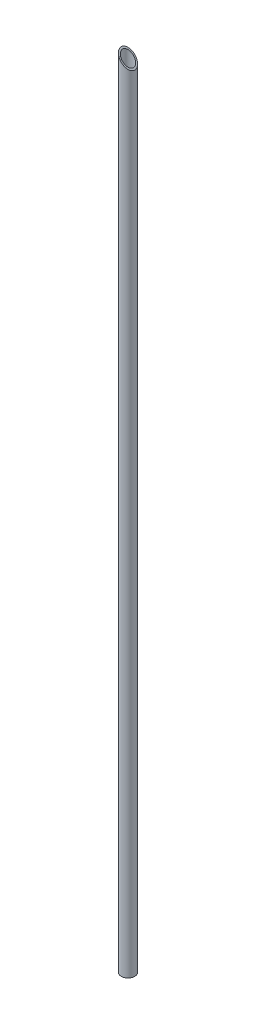
ISO-10303-21;
HEADER;
FILE_DESCRIPTION(('STEP AP214'),'2;1');
FILE_NAME('part.step','',(''),(''),'','','');
FILE_SCHEMA(('AUTOMOTIVE_DESIGN { 1 0 10303 214 1 1 1 1 }'));
ENDSEC;
DATA;
#1=APPLICATION_CONTEXT('core data for automotive mechanical design processes');
#2=APPLICATION_PROTOCOL_DEFINITION('international standard','automotive_design',2000,#1);
#3=PRODUCT_CONTEXT('',#1,'mechanical');
#4=PRODUCT('Part','Part','',(#3));
#5=PRODUCT_RELATED_PRODUCT_CATEGORY('part','',(#4));
#6=PRODUCT_DEFINITION_FORMATION('','',#4);
#7=PRODUCT_DEFINITION_CONTEXT('part definition',#1,'design');
#8=PRODUCT_DEFINITION('design','',#6,#7);
#9=PRODUCT_DEFINITION_SHAPE('','',#8);
#10=(LENGTH_UNIT() NAMED_UNIT(*) SI_UNIT(.MILLI.,.METRE.));
#11=(NAMED_UNIT(*) PLANE_ANGLE_UNIT() SI_UNIT($,.RADIAN.));
#12=(NAMED_UNIT(*) SI_UNIT($,.STERADIAN.) SOLID_ANGLE_UNIT());
#13=UNCERTAINTY_MEASURE_WITH_UNIT(LENGTH_MEASURE(1.E-05),#10,'distance_accuracy_value','');
#14=(GEOMETRIC_REPRESENTATION_CONTEXT(3) GLOBAL_UNCERTAINTY_ASSIGNED_CONTEXT((#13)) GLOBAL_UNIT_ASSIGNED_CONTEXT((#10,
#11,#12)) REPRESENTATION_CONTEXT('',''));
#15=CARTESIAN_POINT('',(0.,0.,0.));
#16=DIRECTION('',(0.,0.,1.));
#17=DIRECTION('',(1.,0.,0.));
#18=AXIS2_PLACEMENT_3D('',#15,#16,#17);
#19=CARTESIAN_POINT('',(0.,0.,0.));
#20=DIRECTION('',(0.,1.,0.));
#21=DIRECTION('',(0.,0.,1.));
#22=AXIS2_PLACEMENT_3D('',#19,#20,#21);
#23=CYLINDRICAL_SURFACE('',#22,13.3223);
#24=CARTESIAN_POINT('',(0.,0.,0.));
#25=DIRECTION('',(0.,1.,0.));
#26=DIRECTION('',(0.,0.,1.));
#27=AXIS2_PLACEMENT_3D('',#24,#25,#26);
#28=CIRCLE('',#27,13.3223);
#29=CARTESIAN_POINT('',(0.,0.,13.3223));
#30=VERTEX_POINT('',#29);
#31=EDGE_CURVE('E17',#30,#30,#28,.F.);
#32=ORIENTED_EDGE('',*,*,#31,.T.);
#33=EDGE_LOOP('',(#32));
#34=FACE_BOUND('',#33,.T.);
#35=CARTESIAN_POINT('',(0.,1951.7995,0.));
#36=DIRECTION('',(-0.707106781186548,-0.707106781186548,0.));
#37=DIRECTION('',(-0.707106781186548,0.707106781186548,0.));
#38=AXIS2_PLACEMENT_3D('',#35,#36,#37);
#39=ELLIPSE('',#38,18.8405773420031,13.3223);
#40=CARTESIAN_POINT('',(-13.3223,1965.1218,0.));
#41=VERTEX_POINT('',#40);
#42=EDGE_CURVE('E26',#41,#41,#39,.F.);
#43=ORIENTED_EDGE('',*,*,#42,.T.);
#44=EDGE_LOOP('',(#43));
#45=FACE_BOUND('',#44,.T.);
#46=ADVANCED_FACE('F14',(#34,#45),#23,.F.);
#47=CARTESIAN_POINT('',(0.,0.,0.));
#48=DIRECTION('',(0.,1.,0.));
#49=DIRECTION('',(0.,0.,1.));
#50=AXIS2_PLACEMENT_3D('',#47,#48,#49);
#51=PLANE('',#50);
#52=ORIENTED_EDGE('',*,*,#31,.F.);
#53=EDGE_LOOP('',(#52));
#54=FACE_BOUND('',#53,.T.);
#55=CARTESIAN_POINT('',(0.,0.,0.));
#56=DIRECTION('',(0.,1.,0.));
#57=DIRECTION('',(0.,0.,1.));
#58=AXIS2_PLACEMENT_3D('',#55,#56,#57);
#59=CIRCLE('',#58,16.7005);
#60=CARTESIAN_POINT('',(0.,0.,16.7005));
#61=VERTEX_POINT('',#60);
#62=EDGE_CURVE('E21',#61,#61,#59,.T.);
#63=ORIENTED_EDGE('',*,*,#62,.F.);
#64=EDGE_LOOP('',(#63));
#65=FACE_BOUND('',#64,.T.);
#66=ADVANCED_FACE('F35',(#54,#65),#51,.F.);
#67=CARTESIAN_POINT('',(-16.7005,1968.5,-246.1387));
#68=DIRECTION('',(-0.707106781186548,-0.707106781186548,0.));
#69=DIRECTION('',(0.707106781186548,-0.707106781186548,0.));
#70=AXIS2_PLACEMENT_3D('',#67,#68,#69);
#71=PLANE('',#70);
#72=ORIENTED_EDGE('',*,*,#42,.F.);
#73=EDGE_LOOP('',(#72));
#74=FACE_BOUND('',#73,.T.);
#75=CARTESIAN_POINT('',(0.,1951.7995,0.));
#76=DIRECTION('',(-0.707106781186548,-0.707106781186548,0.));
#77=DIRECTION('',(-0.707106781186548,0.707106781186548,0.));
#78=AXIS2_PLACEMENT_3D('',#75,#76,#77);
#79=ELLIPSE('',#78,23.6180735984119,16.7005);
#80=CARTESIAN_POINT('',(-16.7005,1968.5,0.));
#81=VERTEX_POINT('',#80);
#82=EDGE_CURVE('E10',#81,#81,#79,.T.);
#83=ORIENTED_EDGE('',*,*,#82,.F.);
#84=EDGE_LOOP('',(#83));
#85=FACE_BOUND('',#84,.T.);
#86=ADVANCED_FACE('F38',(#74,#85),#71,.F.);
#87=CARTESIAN_POINT('',(0.,0.,0.));
#88=DIRECTION('',(0.,1.,0.));
#89=DIRECTION('',(0.,0.,1.));
#90=AXIS2_PLACEMENT_3D('',#87,#88,#89);
#91=CYLINDRICAL_SURFACE('',#90,16.7005);
#92=ORIENTED_EDGE('',*,*,#62,.T.);
#93=EDGE_LOOP('',(#92));
#94=FACE_BOUND('',#93,.T.);
#95=ORIENTED_EDGE('',*,*,#82,.T.);
#96=EDGE_LOOP('',(#95));
#97=FACE_BOUND('',#96,.T.);
#98=ADVANCED_FACE('F41',(#94,#97),#91,.T.);
#99=CLOSED_SHELL('',(#46,#66,#86,#98));
#100=MANIFOLD_SOLID_BREP('B1',#99);
#101=ADVANCED_BREP_SHAPE_REPRESENTATION('',(#18,#100),#14);
#102=SHAPE_DEFINITION_REPRESENTATION(#9,#101);
ENDSEC;
END-ISO-10303-21;
